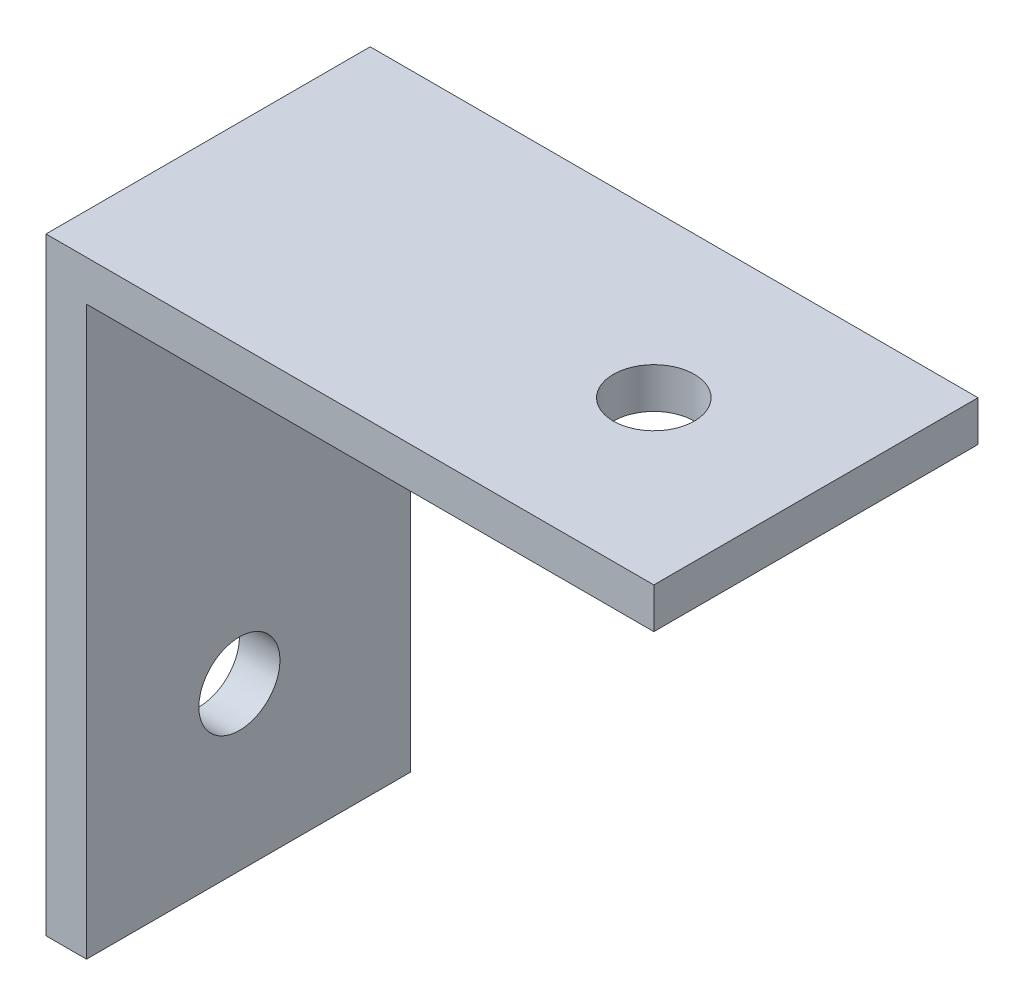
ISO-10303-21;
HEADER;
FILE_DESCRIPTION(('STEP AP214'),'2;1');
FILE_NAME('part.step','',(''),(''),'','','');
FILE_SCHEMA(('AUTOMOTIVE_DESIGN { 1 0 10303 214 1 1 1 1 }'));
ENDSEC;
DATA;
#1=APPLICATION_CONTEXT('core data for automotive mechanical design processes');
#2=APPLICATION_PROTOCOL_DEFINITION('international standard','automotive_design',2000,#1);
#3=PRODUCT_CONTEXT('',#1,'mechanical');
#4=PRODUCT('Part','Part','',(#3));
#5=PRODUCT_RELATED_PRODUCT_CATEGORY('part','',(#4));
#6=PRODUCT_DEFINITION_FORMATION('','',#4);
#7=PRODUCT_DEFINITION_CONTEXT('part definition',#1,'design');
#8=PRODUCT_DEFINITION('design','',#6,#7);
#9=PRODUCT_DEFINITION_SHAPE('','',#8);
#10=(LENGTH_UNIT() NAMED_UNIT(*) SI_UNIT(.MILLI.,.METRE.));
#11=(NAMED_UNIT(*) PLANE_ANGLE_UNIT() SI_UNIT($,.RADIAN.));
#12=(NAMED_UNIT(*) SI_UNIT($,.STERADIAN.) SOLID_ANGLE_UNIT());
#13=UNCERTAINTY_MEASURE_WITH_UNIT(LENGTH_MEASURE(1.E-05),#10,'distance_accuracy_value','');
#14=(GEOMETRIC_REPRESENTATION_CONTEXT(3) GLOBAL_UNCERTAINTY_ASSIGNED_CONTEXT((#13)) GLOBAL_UNIT_ASSIGNED_CONTEXT((#10,
#11,#12)) REPRESENTATION_CONTEXT('',''));
#15=CARTESIAN_POINT('',(0.,0.,0.));
#16=DIRECTION('',(0.,0.,1.));
#17=DIRECTION('',(1.,0.,0.));
#18=AXIS2_PLACEMENT_3D('',#15,#16,#17);
#19=CARTESIAN_POINT('',(2.71832660734472,17.8140607084461,16.));
#20=DIRECTION('',(0.,-1.,0.));
#21=DIRECTION('',(0.,0.,-1.));
#22=AXIS2_PLACEMENT_3D('',#19,#20,#21);
#23=PLANE('',#22);
#24=CARTESIAN_POINT('',(-5.28167339265528,17.8140607084461,8.));
#25=DIRECTION('',(0.,1.,0.));
#26=DIRECTION('',(0.,0.,1.));
#27=AXIS2_PLACEMENT_3D('',#24,#25,#26);
#28=CIRCLE('',#27,2.);
#29=CARTESIAN_POINT('',(-5.28167339265528,17.8140607084461,10.));
#30=VERTEX_POINT('',#29);
#31=EDGE_CURVE('E138',#30,#30,#28,.T.);
#32=ORIENTED_EDGE('',*,*,#31,.F.);
#33=EDGE_LOOP('',(#32));
#34=FACE_BOUND('',#33,.T.);
#35=DIRECTION('',(-1.,0.,0.));
#36=VECTOR('',#35,1.);
#37=CARTESIAN_POINT('',(2.71832660734472,17.8140607084461,0.));
#38=LINE('',#37,#36);
#39=CARTESIAN_POINT('',(2.71832660734472,17.8140607084461,0.));
#40=VERTEX_POINT('',#39);
#41=CARTESIAN_POINT('',(-27.2816733926553,17.8140607084461,0.));
#42=VERTEX_POINT('',#41);
#43=EDGE_CURVE('E121',#40,#42,#38,.T.);
#44=ORIENTED_EDGE('',*,*,#43,.T.);
#45=DIRECTION('',(0.,0.,-1.));
#46=VECTOR('',#45,1.);
#47=CARTESIAN_POINT('',(-27.2816733926553,17.8140607084461,16.));
#48=LINE('',#47,#46);
#49=CARTESIAN_POINT('',(-27.2816733926553,17.8140607084461,16.));
#50=VERTEX_POINT('',#49);
#51=EDGE_CURVE('E11',#50,#42,#48,.T.);
#52=ORIENTED_EDGE('',*,*,#51,.F.);
#53=DIRECTION('',(-1.,0.,0.));
#54=VECTOR('',#53,1.);
#55=CARTESIAN_POINT('',(2.71832660734472,17.8140607084461,16.));
#56=LINE('',#55,#54);
#57=CARTESIAN_POINT('',(2.71832660734472,17.8140607084461,16.));
#58=VERTEX_POINT('',#57);
#59=EDGE_CURVE('E132',#58,#50,#56,.T.);
#60=ORIENTED_EDGE('',*,*,#59,.F.);
#61=DIRECTION('',(0.,0.,-1.));
#62=VECTOR('',#61,1.);
#63=CARTESIAN_POINT('',(2.71832660734472,17.8140607084461,16.));
#64=LINE('',#63,#62);
#65=EDGE_CURVE('E117',#58,#40,#64,.T.);
#66=ORIENTED_EDGE('',*,*,#65,.T.);
#67=EDGE_LOOP('',(#44,#52,#60,#66));
#68=FACE_BOUND('',#67,.T.);
#69=ADVANCED_FACE('F35',(#34,#68),#23,.F.);
#70=CARTESIAN_POINT('',(-27.2816733926553,17.8140607084461,16.));
#71=DIRECTION('',(1.,0.,0.));
#72=DIRECTION('',(0.,0.,-1.));
#73=AXIS2_PLACEMENT_3D('',#70,#71,#72);
#74=PLANE('',#73);
#75=CARTESIAN_POINT('',(-27.2816733926553,-4.18124628786187,8.45438985262081));
#76=DIRECTION('',(-1.,0.,0.));
#77=DIRECTION('',(0.,0.,1.));
#78=AXIS2_PLACEMENT_3D('',#75,#76,#77);
#79=CIRCLE('',#78,2.);
#80=CARTESIAN_POINT('',(-27.2816733926553,-4.18124628786187,10.4543898526208));
#81=VERTEX_POINT('',#80);
#82=EDGE_CURVE('E146',#81,#81,#79,.T.);
#83=ORIENTED_EDGE('',*,*,#82,.F.);
#84=EDGE_LOOP('',(#83));
#85=FACE_BOUND('',#84,.T.);
#86=DIRECTION('',(0.,-1.,0.));
#87=VECTOR('',#86,1.);
#88=CARTESIAN_POINT('',(-27.2816733926553,17.8140607084461,0.));
#89=LINE('',#88,#87);
#90=CARTESIAN_POINT('',(-27.2816733926553,-12.1859392915539,0.));
#91=VERTEX_POINT('',#90);
#92=EDGE_CURVE('E124',#42,#91,#89,.T.);
#93=ORIENTED_EDGE('',*,*,#92,.T.);
#94=DIRECTION('',(0.,0.,-1.));
#95=VECTOR('',#94,1.);
#96=CARTESIAN_POINT('',(-27.2816733926553,-12.1859392915539,16.));
#97=LINE('',#96,#95);
#98=CARTESIAN_POINT('',(-27.2816733926553,-12.1859392915539,16.));
#99=VERTEX_POINT('',#98);
#100=EDGE_CURVE('E44',#99,#91,#97,.T.);
#101=ORIENTED_EDGE('',*,*,#100,.F.);
#102=DIRECTION('',(0.,-1.,0.));
#103=VECTOR('',#102,1.);
#104=CARTESIAN_POINT('',(-27.2816733926553,17.8140607084461,16.));
#105=LINE('',#104,#103);
#106=EDGE_CURVE('E90',#50,#99,#105,.T.);
#107=ORIENTED_EDGE('',*,*,#106,.F.);
#108=ORIENTED_EDGE('',*,*,#51,.T.);
#109=EDGE_LOOP('',(#93,#101,#107,#108));
#110=FACE_BOUND('',#109,.T.);
#111=ADVANCED_FACE('F152',(#85,#110),#74,.F.);
#112=CARTESIAN_POINT('',(-27.2816733926553,-12.1859392915539,16.));
#113=DIRECTION('',(0.,1.,0.));
#114=DIRECTION('',(0.,0.,1.));
#115=AXIS2_PLACEMENT_3D('',#112,#113,#114);
#116=PLANE('',#115);
#117=DIRECTION('',(1.,0.,0.));
#118=VECTOR('',#117,1.);
#119=CARTESIAN_POINT('',(-27.2816733926553,-12.1859392915539,0.));
#120=LINE('',#119,#118);
#121=CARTESIAN_POINT('',(-25.2816733926553,-12.1859392915539,0.));
#122=VERTEX_POINT('',#121);
#123=EDGE_CURVE('E127',#91,#122,#120,.T.);
#124=ORIENTED_EDGE('',*,*,#123,.T.);
#125=DIRECTION('',(0.,0.,-1.));
#126=VECTOR('',#125,1.);
#127=CARTESIAN_POINT('',(-25.2816733926553,-12.1859392915539,16.));
#128=LINE('',#127,#126);
#129=CARTESIAN_POINT('',(-25.2816733926553,-12.1859392915539,16.));
#130=VERTEX_POINT('',#129);
#131=EDGE_CURVE('E112',#130,#122,#128,.T.);
#132=ORIENTED_EDGE('',*,*,#131,.F.);
#133=DIRECTION('',(1.,0.,0.));
#134=VECTOR('',#133,1.);
#135=CARTESIAN_POINT('',(-27.2816733926553,-12.1859392915539,16.));
#136=LINE('',#135,#134);
#137=EDGE_CURVE('E103',#99,#130,#136,.T.);
#138=ORIENTED_EDGE('',*,*,#137,.F.);
#139=ORIENTED_EDGE('',*,*,#100,.T.);
#140=EDGE_LOOP('',(#124,#132,#138,#139));
#141=FACE_BOUND('',#140,.T.);
#142=ADVANCED_FACE('F155',(#141),#116,.F.);
#143=CARTESIAN_POINT('',(-25.2816733926553,-12.1859392915539,16.));
#144=DIRECTION('',(-1.,0.,0.));
#145=DIRECTION('',(0.,0.,1.));
#146=AXIS2_PLACEMENT_3D('',#143,#144,#145);
#147=PLANE('',#146);
#148=CARTESIAN_POINT('',(-25.2816733926553,-4.18124628786187,8.45438985262081));
#149=DIRECTION('',(-1.,0.,0.));
#150=DIRECTION('',(0.,0.,1.));
#151=AXIS2_PLACEMENT_3D('',#148,#149,#150);
#152=CIRCLE('',#151,2.);
#153=CARTESIAN_POINT('',(-25.2816733926553,-4.18124628786187,10.4543898526208));
#154=VERTEX_POINT('',#153);
#155=EDGE_CURVE('E38',#154,#154,#152,.T.);
#156=ORIENTED_EDGE('',*,*,#155,.T.);
#157=EDGE_LOOP('',(#156));
#158=FACE_BOUND('',#157,.T.);
#159=DIRECTION('',(0.,1.,0.));
#160=VECTOR('',#159,1.);
#161=CARTESIAN_POINT('',(-25.2816733926553,-12.1859392915539,0.));
#162=LINE('',#161,#160);
#163=CARTESIAN_POINT('',(-25.2816733926553,15.8140607084461,0.));
#164=VERTEX_POINT('',#163);
#165=EDGE_CURVE('E111',#122,#164,#162,.T.);
#166=ORIENTED_EDGE('',*,*,#165,.T.);
#167=DIRECTION('',(0.,0.,-1.));
#168=VECTOR('',#167,1.);
#169=CARTESIAN_POINT('',(-25.2816733926553,15.8140607084461,16.));
#170=LINE('',#169,#168);
#171=CARTESIAN_POINT('',(-25.2816733926553,15.8140607084461,16.));
#172=VERTEX_POINT('',#171);
#173=EDGE_CURVE('E108',#172,#164,#170,.T.);
#174=ORIENTED_EDGE('',*,*,#173,.F.);
#175=DIRECTION('',(0.,1.,0.));
#176=VECTOR('',#175,1.);
#177=CARTESIAN_POINT('',(-25.2816733926553,-12.1859392915539,16.));
#178=LINE('',#177,#176);
#179=EDGE_CURVE('E97',#130,#172,#178,.T.);
#180=ORIENTED_EDGE('',*,*,#179,.F.);
#181=ORIENTED_EDGE('',*,*,#131,.T.);
#182=EDGE_LOOP('',(#166,#174,#180,#181));
#183=FACE_BOUND('',#182,.T.);
#184=ADVANCED_FACE('F109',(#158,#183),#147,.F.);
#185=CARTESIAN_POINT('',(-25.2816733926553,15.8140607084461,16.));
#186=DIRECTION('',(0.,1.,0.));
#187=DIRECTION('',(0.,0.,1.));
#188=AXIS2_PLACEMENT_3D('',#185,#186,#187);
#189=PLANE('',#188);
#190=CARTESIAN_POINT('',(-5.28167339265528,15.8140607084461,8.));
#191=DIRECTION('',(0.,1.,0.));
#192=DIRECTION('',(0.,0.,1.));
#193=AXIS2_PLACEMENT_3D('',#190,#191,#192);
#194=CIRCLE('',#193,2.);
#195=CARTESIAN_POINT('',(-5.28167339265528,15.8140607084461,10.));
#196=VERTEX_POINT('',#195);
#197=EDGE_CURVE('E125',#196,#196,#194,.T.);
#198=ORIENTED_EDGE('',*,*,#197,.T.);
#199=EDGE_LOOP('',(#198));
#200=FACE_BOUND('',#199,.T.);
#201=DIRECTION('',(1.,0.,0.));
#202=VECTOR('',#201,1.);
#203=CARTESIAN_POINT('',(-25.2816733926553,15.8140607084461,0.));
#204=LINE('',#203,#202);
#205=CARTESIAN_POINT('',(2.71832660734472,15.8140607084461,0.));
#206=VERTEX_POINT('',#205);
#207=EDGE_CURVE('E76',#164,#206,#204,.T.);
#208=ORIENTED_EDGE('',*,*,#207,.T.);
#209=DIRECTION('',(0.,0.,-1.));
#210=VECTOR('',#209,1.);
#211=CARTESIAN_POINT('',(2.71832660734472,15.8140607084461,16.));
#212=LINE('',#211,#210);
#213=CARTESIAN_POINT('',(2.71832660734472,15.8140607084461,16.));
#214=VERTEX_POINT('',#213);
#215=EDGE_CURVE('E113',#214,#206,#212,.T.);
#216=ORIENTED_EDGE('',*,*,#215,.F.);
#217=DIRECTION('',(1.,0.,0.));
#218=VECTOR('',#217,1.);
#219=CARTESIAN_POINT('',(-25.2816733926553,15.8140607084461,16.));
#220=LINE('',#219,#218);
#221=EDGE_CURVE('E101',#172,#214,#220,.T.);
#222=ORIENTED_EDGE('',*,*,#221,.F.);
#223=ORIENTED_EDGE('',*,*,#173,.T.);
#224=EDGE_LOOP('',(#208,#216,#222,#223));
#225=FACE_BOUND('',#224,.T.);
#226=ADVANCED_FACE('F115',(#200,#225),#189,.F.);
#227=CARTESIAN_POINT('',(2.71832660734472,15.8140607084461,16.));
#228=DIRECTION('',(-1.,0.,0.));
#229=DIRECTION('',(0.,0.,1.));
#230=AXIS2_PLACEMENT_3D('',#227,#228,#229);
#231=PLANE('',#230);
#232=DIRECTION('',(0.,1.,0.));
#233=VECTOR('',#232,1.);
#234=CARTESIAN_POINT('',(2.71832660734472,15.8140607084461,0.));
#235=LINE('',#234,#233);
#236=EDGE_CURVE('E82',#206,#40,#235,.T.);
#237=ORIENTED_EDGE('',*,*,#236,.T.);
#238=ORIENTED_EDGE('',*,*,#65,.F.);
#239=DIRECTION('',(0.,1.,0.));
#240=VECTOR('',#239,1.);
#241=CARTESIAN_POINT('',(2.71832660734472,15.8140607084461,16.));
#242=LINE('',#241,#240);
#243=EDGE_CURVE('E53',#214,#58,#242,.T.);
#244=ORIENTED_EDGE('',*,*,#243,.F.);
#245=ORIENTED_EDGE('',*,*,#215,.T.);
#246=EDGE_LOOP('',(#237,#238,#244,#245));
#247=FACE_BOUND('',#246,.T.);
#248=ADVANCED_FACE('F160',(#247),#231,.F.);
#249=CARTESIAN_POINT('',(0.,0.,16.));
#250=DIRECTION('',(0.,0.,1.));
#251=DIRECTION('',(1.,0.,0.));
#252=AXIS2_PLACEMENT_3D('',#249,#250,#251);
#253=PLANE('',#252);
#254=ORIENTED_EDGE('',*,*,#59,.T.);
#255=ORIENTED_EDGE('',*,*,#106,.T.);
#256=ORIENTED_EDGE('',*,*,#137,.T.);
#257=ORIENTED_EDGE('',*,*,#179,.T.);
#258=ORIENTED_EDGE('',*,*,#221,.T.);
#259=ORIENTED_EDGE('',*,*,#243,.T.);
#260=EDGE_LOOP('',(#254,#255,#256,#257,#258,#259));
#261=FACE_BOUND('',#260,.T.);
#262=ADVANCED_FACE('F99',(#261),#253,.T.);
#263=CARTESIAN_POINT('',(0.,0.,0.));
#264=DIRECTION('',(0.,0.,1.));
#265=DIRECTION('',(1.,0.,0.));
#266=AXIS2_PLACEMENT_3D('',#263,#264,#265);
#267=PLANE('',#266);
#268=ORIENTED_EDGE('',*,*,#43,.F.);
#269=ORIENTED_EDGE('',*,*,#236,.F.);
#270=ORIENTED_EDGE('',*,*,#207,.F.);
#271=ORIENTED_EDGE('',*,*,#165,.F.);
#272=ORIENTED_EDGE('',*,*,#123,.F.);
#273=ORIENTED_EDGE('',*,*,#92,.F.);
#274=EDGE_LOOP('',(#268,#269,#270,#271,#272,#273));
#275=FACE_BOUND('',#274,.T.);
#276=ADVANCED_FACE('F158',(#275),#267,.F.);
#277=CARTESIAN_POINT('',(-5.28167339265528,1.81406070844613,8.));
#278=DIRECTION('',(0.,1.,0.));
#279=DIRECTION('',(0.,0.,1.));
#280=AXIS2_PLACEMENT_3D('',#277,#278,#279);
#281=CYLINDRICAL_SURFACE('',#280,2.);
#282=ORIENTED_EDGE('',*,*,#31,.T.);
#283=EDGE_LOOP('',(#282));
#284=FACE_BOUND('',#283,.T.);
#285=ORIENTED_EDGE('',*,*,#197,.F.);
#286=EDGE_LOOP('',(#285));
#287=FACE_BOUND('',#286,.T.);
#288=ADVANCED_FACE('F190',(#284,#287),#281,.F.);
#289=CARTESIAN_POINT('',(-11.2816733926553,-4.18124628786187,8.45438985262081));
#290=DIRECTION('',(-1.,0.,0.));
#291=DIRECTION('',(0.,0.,1.));
#292=AXIS2_PLACEMENT_3D('',#289,#290,#291);
#293=CYLINDRICAL_SURFACE('',#292,2.);
#294=ORIENTED_EDGE('',*,*,#82,.T.);
#295=EDGE_LOOP('',(#294));
#296=FACE_BOUND('',#295,.T.);
#297=ORIENTED_EDGE('',*,*,#155,.F.);
#298=EDGE_LOOP('',(#297));
#299=FACE_BOUND('',#298,.T.);
#300=ADVANCED_FACE('F188',(#296,#299),#293,.F.);
#301=CLOSED_SHELL('',(#69,#111,#142,#184,#226,#248,#262,#276,#288,#300));
#302=MANIFOLD_SOLID_BREP('B2',#301);
#303=ADVANCED_BREP_SHAPE_REPRESENTATION('',(#18,#302),#14);
#304=SHAPE_DEFINITION_REPRESENTATION(#9,#303);
ENDSEC;
END-ISO-10303-21;
